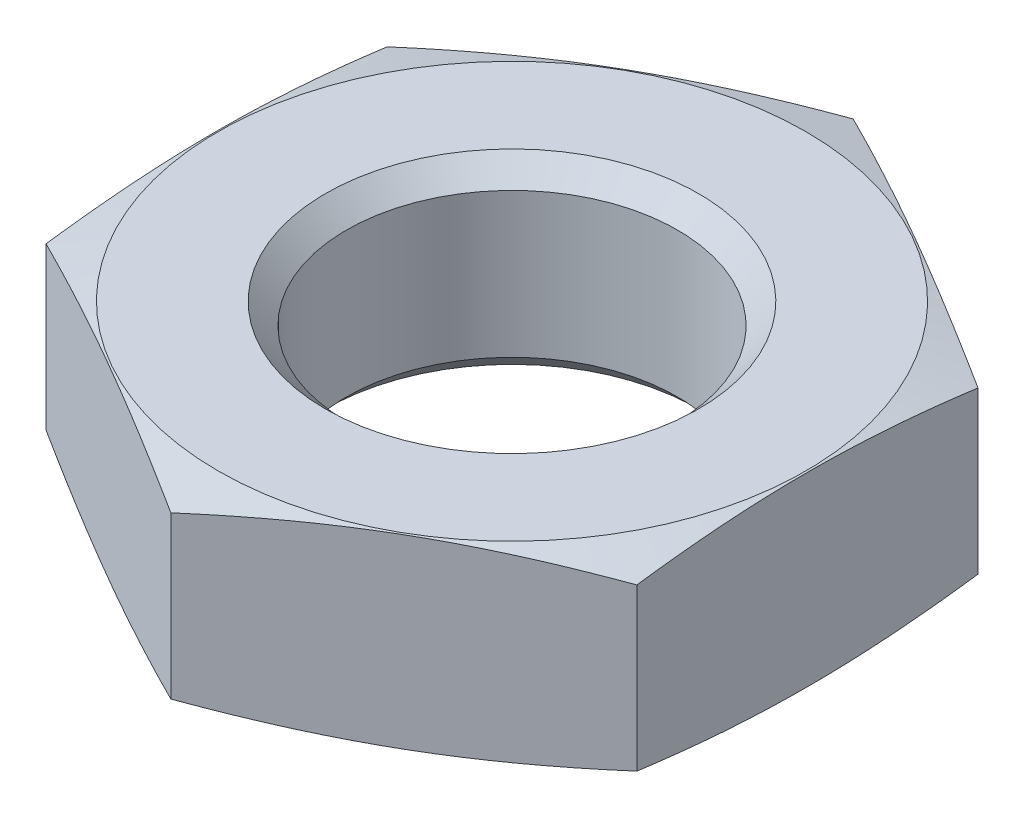
ISO-10303-21;
HEADER;
FILE_DESCRIPTION(('STEP AP214'),'2;1');
FILE_NAME('part.step','',(''),(''),'','','');
FILE_SCHEMA(('AUTOMOTIVE_DESIGN { 1 0 10303 214 1 1 1 1 }'));
ENDSEC;
DATA;
#1=APPLICATION_CONTEXT('core data for automotive mechanical design processes');
#2=APPLICATION_PROTOCOL_DEFINITION('international standard','automotive_design',2000,#1);
#3=PRODUCT_CONTEXT('',#1,'mechanical');
#4=PRODUCT('Part','Part','',(#3));
#5=PRODUCT_RELATED_PRODUCT_CATEGORY('part','',(#4));
#6=PRODUCT_DEFINITION_FORMATION('','',#4);
#7=PRODUCT_DEFINITION_CONTEXT('part definition',#1,'design');
#8=PRODUCT_DEFINITION('design','',#6,#7);
#9=PRODUCT_DEFINITION_SHAPE('','',#8);
#10=(LENGTH_UNIT() NAMED_UNIT(*) SI_UNIT(.MILLI.,.METRE.));
#11=(NAMED_UNIT(*) PLANE_ANGLE_UNIT() SI_UNIT($,.RADIAN.));
#12=(NAMED_UNIT(*) SI_UNIT($,.STERADIAN.) SOLID_ANGLE_UNIT());
#13=UNCERTAINTY_MEASURE_WITH_UNIT(LENGTH_MEASURE(1.E-05),#10,'distance_accuracy_value','');
#14=(GEOMETRIC_REPRESENTATION_CONTEXT(3) GLOBAL_UNCERTAINTY_ASSIGNED_CONTEXT((#13)) GLOBAL_UNIT_ASSIGNED_CONTEXT((#10,
#11,#12)) REPRESENTATION_CONTEXT('',''));
#15=CARTESIAN_POINT('',(0.,0.,0.));
#16=DIRECTION('',(0.,0.,1.));
#17=DIRECTION('',(1.,0.,0.));
#18=AXIS2_PLACEMENT_3D('',#15,#16,#17);
#19=CARTESIAN_POINT('',(0.,0.,0.));
#20=DIRECTION('',(0.,1.,0.));
#21=DIRECTION('',(0.,0.,1.));
#22=AXIS2_PLACEMENT_3D('',#19,#20,#21);
#23=PLANE('',#22);
#24=CARTESIAN_POINT('',(0.,0.,0.));
#25=DIRECTION('',(0.,-1.,0.));
#26=DIRECTION('',(0.,0.,-1.));
#27=AXIS2_PLACEMENT_3D('',#24,#25,#26);
#28=CIRCLE('',#27,9.45);
#29=CARTESIAN_POINT('',(0.,0.,-9.45));
#30=VERTEX_POINT('',#29);
#31=EDGE_CURVE('E119',#30,#30,#28,.T.);
#32=ORIENTED_EDGE('',*,*,#31,.F.);
#33=EDGE_LOOP('',(#32));
#34=FACE_BOUND('',#33,.T.);
#35=CARTESIAN_POINT('',(0.,0.,0.));
#36=DIRECTION('',(0.,1.,0.));
#37=DIRECTION('',(0.,0.,1.));
#38=AXIS2_PLACEMENT_3D('',#35,#36,#37);
#39=CIRCLE('',#38,6.);
#40=CARTESIAN_POINT('',(0.,0.,6.));
#41=VERTEX_POINT('',#40);
#42=EDGE_CURVE('E110',#41,#41,#39,.T.);
#43=ORIENTED_EDGE('',*,*,#42,.F.);
#44=EDGE_LOOP('',(#43));
#45=FACE_BOUND('',#44,.T.);
#46=ADVANCED_FACE('F41',(#34,#45),#23,.T.);
#47=CARTESIAN_POINT('',(9.45,-6.,0.));
#48=DIRECTION('',(0.,-1.,0.));
#49=DIRECTION('',(0.,0.,-1.));
#50=AXIS2_PLACEMENT_3D('',#47,#48,#49);
#51=PLANE('',#50);
#52=CARTESIAN_POINT('',(0.,-6.,0.));
#53=DIRECTION('',(0.,-1.,0.));
#54=DIRECTION('',(0.,0.,-1.));
#55=AXIS2_PLACEMENT_3D('',#52,#53,#54);
#56=CIRCLE('',#55,9.45);
#57=CARTESIAN_POINT('',(0.,-6.,-9.45));
#58=VERTEX_POINT('',#57);
#59=EDGE_CURVE('E116',#58,#58,#56,.T.);
#60=ORIENTED_EDGE('',*,*,#59,.T.);
#61=EDGE_LOOP('',(#60));
#62=FACE_BOUND('',#61,.T.);
#63=CARTESIAN_POINT('',(0.,-6.,0.));
#64=DIRECTION('',(0.,1.,0.));
#65=DIRECTION('',(0.,0.,1.));
#66=AXIS2_PLACEMENT_3D('',#63,#64,#65);
#67=CIRCLE('',#66,6.);
#68=CARTESIAN_POINT('',(0.,-6.,6.));
#69=VERTEX_POINT('',#68);
#70=EDGE_CURVE('E354',#69,#69,#67,.T.);
#71=ORIENTED_EDGE('',*,*,#70,.T.);
#72=EDGE_LOOP('',(#71));
#73=FACE_BOUND('',#72,.T.);
#74=ADVANCED_FACE('F142',(#62,#73),#51,.T.);
#75=CARTESIAN_POINT('',(0.,-3.,0.));
#76=DIRECTION('',(0.,-1.,0.));
#77=DIRECTION('',(0.,0.,-1.));
#78=AXIS2_PLACEMENT_3D('',#75,#76,#77);
#79=CONICAL_SURFACE('',#78,20.646152422707,1.30899693899576);
#80=ORIENTED_EDGE('',*,*,#31,.T.);
#81=EDGE_LOOP('',(#80));
#82=FACE_BOUND('',#81,.T.);
#83=CARTESIAN_POINT('',(0.000200000000000056,-0.407221301327885,-10.9697705846568));
#84=CARTESIAN_POINT('',(-0.394327722084066,-0.346162628123163,-10.7419898981088));
#85=CARTESIAN_POINT('',(-0.789570756660775,-0.290731476819736,-10.5137962257006));
#86=CARTESIAN_POINT('',(-1.581452623938,-0.193344199932058,-10.0566030164617));
#87=CARTESIAN_POINT('',(-1.97809195762644,-0.151393547355208,-9.82760319038551));
#88=CARTESIAN_POINT('',(-2.77036165664143,-0.0834162658033326,-9.37018606638841));
#89=CARTESIAN_POINT('',(-3.16598666491861,-0.0573085729421514,-9.14177186136143));
#90=CARTESIAN_POINT('',(-3.95774119043103,-0.0223008344010164,-8.68465217292471));
#91=CARTESIAN_POINT('',(-4.35387059521551,-0.0133974596215648,-8.45594675443846));
#92=CARTESIAN_POINT('',(-5.14612940478448,-0.0133974596215617,-7.99853591746594));
#93=CARTESIAN_POINT('',(-5.54225880956897,-0.0223008344010103,-7.76983049897969));
#94=CARTESIAN_POINT('',(-6.33401333508139,-0.0573085729421384,-7.31271081054298));
#95=CARTESIAN_POINT('',(-6.72963834335857,-0.0834162658033158,-7.08429660551599));
#96=CARTESIAN_POINT('',(-7.52190804237356,-0.151393547355185,-6.62687948151889));
#97=CARTESIAN_POINT('',(-7.918547376062,-0.193344199932032,-6.39787965544267));
#98=CARTESIAN_POINT('',(-8.71042924333922,-0.290731476819705,-5.94068644620377));
#99=CARTESIAN_POINT('',(-9.10567227791593,-0.34616262812313,-5.71249277379557));
#100=CARTESIAN_POINT('',(-9.5002,-0.407221301327848,-5.48471208724756));
#101=B_SPLINE_CURVE_WITH_KNOTS('',3,(#83,#84,#85,#86,#87,#88,#89,#90,#91,#92,#93,#94,#95,#96,
#97,#98,#99,#100),.UNSPECIFIED.,.F.,.F.,(4,2,2,2,2,2,2,2,4),(0.,1.3789772207545,
2.75851359330416,4.13093041065499,5.50308163364597,6.87523285663696,8.24764967398779,
9.62718604653745,11.0061632672919),.UNSPECIFIED.);
#102=CARTESIAN_POINT('',(0.,-0.407190360731685,-10.969655114603));
#103=VERTEX_POINT('',#102);
#104=CARTESIAN_POINT('',(-9.5,-0.407190360731649,-5.4848275573014));
#105=VERTEX_POINT('',#104);
#106=EDGE_CURVE('E115',#103,#105,#101,.T.);
#107=ORIENTED_EDGE('',*,*,#106,.T.);
#108=CARTESIAN_POINT('',(-9.5,-2.15489501698503,-14.6876233707618));
#109=CARTESIAN_POINT('',(-9.5,-2.05747716397326,-14.2545187729878));
#110=CARTESIAN_POINT('',(-9.5,-1.96122137129006,-13.8211481413857));
#111=CARTESIAN_POINT('',(-9.5,-1.77166156275838,-12.9537437450985));
#112=CARTESIAN_POINT('',(-9.5,-1.67835766923983,-12.5197099537106));
#113=CARTESIAN_POINT('',(-9.5,-1.49525385277399,-11.6504869953931));
#114=CARTESIAN_POINT('',(-9.5,-1.40545721001753,-11.2152971350782));
#115=CARTESIAN_POINT('',(-9.5,-1.23030852784947,-10.3440243718609));
#116=CARTESIAN_POINT('',(-9.5,-1.14495645264905,-9.90794147617888));
#117=CARTESIAN_POINT('',(-9.5,-0.980435214143318,-9.03829746415853));
#118=CARTESIAN_POINT('',(-9.5,-0.901221214976989,-8.60474487085485));
#119=CARTESIAN_POINT('',(-9.5,-0.749512932392226,-7.73645645042536));
#120=CARTESIAN_POINT('',(-9.5,-0.67701867314438,-7.30172061904929));
#121=CARTESIAN_POINT('',(-9.5,-0.540346841485042,-6.43097416556345));
#122=CARTESIAN_POINT('',(-9.5,-0.476168490905241,-5.99496366664183));
#123=CARTESIAN_POINT('',(-9.5,-0.357986001125337,-5.12155005840548));
#124=CARTESIAN_POINT('',(-9.5,-0.303981879128376,-4.68414694673731));
#125=CARTESIAN_POINT('',(-9.5,-0.207635614421435,-3.80292659185121));
#126=CARTESIAN_POINT('',(-9.5,-0.165435340010282,-3.35909360698235));
#127=CARTESIAN_POINT('',(-9.5,-0.0955852694741966,-2.47027404803031));
#128=CARTESIAN_POINT('',(-9.5,-0.067935139015511,-2.02528750068985));
#129=CARTESIAN_POINT('',(-9.5,-0.0287954228788492,-1.13481553211756));
#130=CARTESIAN_POINT('',(-9.5,-0.0172976571081556,-0.689330477833301));
#131=CARTESIAN_POINT('',(-9.5,-0.0111732764429912,0.201756887724333));
#132=CARTESIAN_POINT('',(-9.5,-0.0165466177806685,0.647359198690513));
#133=CARTESIAN_POINT('',(-9.5,-0.0438678679527058,1.53978594873361));
#134=CARTESIAN_POINT('',(-9.5,-0.065880392707515,1.98660836874645));
#135=CARTESIAN_POINT('',(-9.5,-0.12521232749421,2.87922648621127));
#136=CARTESIAN_POINT('',(-9.5,-0.162532088532708,3.32502215988343));
#137=CARTESIAN_POINT('',(-9.5,-0.250549736602095,4.21558410441264));
#138=CARTESIAN_POINT('',(-9.5,-0.301256943409479,4.66034943954976));
#139=CARTESIAN_POINT('',(-9.5,-0.41388476580013,5.5484407314659));
#140=CARTESIAN_POINT('',(-9.5,-0.475805399572583,5.99176668590894));
#141=CARTESIAN_POINT('',(-9.5,-0.610063914957439,6.88527481636762));
#142=CARTESIAN_POINT('',(-9.5,-0.682574416845879,7.33543081010672));
#143=CARTESIAN_POINT('',(-9.5,-0.835259104971586,8.23444833182316));
#144=CARTESIAN_POINT('',(-9.5,-0.915433574034223,8.68330981139851));
#145=CARTESIAN_POINT('',(-9.5,-1.08192720990757,9.57994824082579));
#146=CARTESIAN_POINT('',(-9.5,-1.16824720653629,10.027725035742));
#147=CARTESIAN_POINT('',(-9.5,-1.34580245800188,10.9222931334809));
#148=CARTESIAN_POINT('',(-9.5,-1.43703765140253,11.3690844485486));
#149=CARTESIAN_POINT('',(-9.5,-1.62349726499246,12.2619975970574));
#150=CARTESIAN_POINT('',(-9.5,-1.71872309563522,12.7081191350725));
#151=CARTESIAN_POINT('',(-9.5,-1.91238897494238,13.599665084764));
#152=CARTESIAN_POINT('',(-9.5,-2.01082904385705,14.0450894920299));
#153=CARTESIAN_POINT('',(-9.5,-2.31003706070183,15.3804090328938));
#154=CARTESIAN_POINT('',(-9.5,-2.51470939288304,16.2694287321673));
#155=CARTESIAN_POINT('',(-9.5,-2.92881555735452,18.0359120404948));
#156=CARTESIAN_POINT('',(-9.5,-3.13817104104766,18.9133941407769));
#157=CARTESIAN_POINT('',(-9.5,-3.56181713880884,20.6671864128034));
#158=CARTESIAN_POINT('',(-9.5,-3.77610787087814,21.5434965559953));
#159=CARTESIAN_POINT('',(-9.5,-4.20796592393956,23.2939297294701));
#160=CARTESIAN_POINT('',(-9.5,-4.42552791861861,24.1680540764188));
#161=CARTESIAN_POINT('',(-9.5,-4.75388716488787,25.4787173362136));
#162=CARTESIAN_POINT('',(-9.5,-4.86367423099838,25.9155097694938));
#163=CARTESIAN_POINT('',(-9.5,-5.08384125733177,26.7889447527411));
#164=CARTESIAN_POINT('',(-9.5,-5.19422121697805,27.2255873028535));
#165=CARTESIAN_POINT('',(-9.5,-5.30485748218315,27.6621648928456));
#166=B_SPLINE_CURVE_WITH_KNOTS('',3,(#108,#109,#110,#111,#112,#113,#114,#115,#116,#117,#118,
#119,#120,#121,#122,#123,#124,#125,#126,#127,#128,#129,#130,#131,#132,#133,#134,#135,#136,#137,
#138,#139,#140,#141,#142,#143,#144,#145,#146,#147,#148,#149,#150,#151,#152,#153,#154,#155,#156,
#157,#158,#159,#160,#161,#162,#163,#164,#165),.UNSPECIFIED.,.F.,.F.,(4,2,2,2,2,2,2,2,2,2,2,2,2,
2,2,2,2,2,2,2,2,2,2,2,2,2,2,2,4),(0.,1.33178163560064,2.66361838958637,3.99667230319012,
5.32971548103093,6.6518625097517,7.97401429398861,9.29604226724846,10.6180724758454,
11.9553688719565,13.2926345382789,14.6292227245148,15.965807443311,17.3076094374081,
18.6494422017694,19.9922115681079,21.3349831125585,22.70277681091,24.0706210048084,
25.4386502474928,26.8066623948144,28.1751621999142,29.5436706284689,32.2804475547124,
34.9867644689635,37.6931461582769,40.3955171584583,41.7466524566337,43.0977864410502),.UNSPECIFIED.);
#167=CARTESIAN_POINT('',(-9.5,-0.407190360731649,5.4848275573014));
#168=VERTEX_POINT('',#167);
#169=EDGE_CURVE('E107',#105,#168,#166,.T.);
#170=ORIENTED_EDGE('',*,*,#169,.T.);
#171=CARTESIAN_POINT('',(-9.5002,-0.407221301327849,5.48471208724756));
#172=CARTESIAN_POINT('',(-9.10567227791593,-0.34616262812313,5.71249277379558));
#173=CARTESIAN_POINT('',(-8.71042924333922,-0.290731476819705,5.94068644620377));
#174=CARTESIAN_POINT('',(-7.918547376062,-0.193344199932033,6.39787965544267));
#175=CARTESIAN_POINT('',(-7.52190804237356,-0.151393547355186,6.62687948151889));
#176=CARTESIAN_POINT('',(-6.72963834335857,-0.0834162658033161,7.08429660551599));
#177=CARTESIAN_POINT('',(-6.33401333508139,-0.057308572942138,7.31271081054298));
#178=CARTESIAN_POINT('',(-5.54225880956897,-0.0223008344010096,7.76983049897969));
#179=CARTESIAN_POINT('',(-5.14612940478448,-0.0133974596215615,7.99853591746594));
#180=CARTESIAN_POINT('',(-4.35387059521552,-0.0133974596215649,8.45594675443846));
#181=CARTESIAN_POINT('',(-3.95774119043103,-0.0223008344010164,8.68465217292471));
#182=CARTESIAN_POINT('',(-3.16598666491861,-0.0573085729421515,9.14177186136143));
#183=CARTESIAN_POINT('',(-2.77036165664143,-0.0834162658033331,9.37018606638841));
#184=CARTESIAN_POINT('',(-1.97809195762645,-0.151393547355209,9.82760319038551));
#185=CARTESIAN_POINT('',(-1.581452623938,-0.193344199932058,10.0566030164617));
#186=CARTESIAN_POINT('',(-0.789570756660778,-0.290731476819735,10.5137962257006));
#187=CARTESIAN_POINT('',(-0.394327722084069,-0.346162628123163,10.7419898981088));
#188=CARTESIAN_POINT('',(0.000199999999998323,-0.407221301327884,10.9697705846568));
#189=B_SPLINE_CURVE_WITH_KNOTS('',3,(#171,#172,#173,#174,#175,#176,#177,#178,#179,#180,#181,
#182,#183,#184,#185,#186,#187,#188),.UNSPECIFIED.,.F.,.F.,(4,2,2,2,2,2,2,2,4),(0.,
1.3789772207545,2.75851359330416,4.13093041065499,5.50308163364597,6.87523285663696,
8.24764967398779,9.62718604653745,11.0061632672919),.UNSPECIFIED.);
#190=CARTESIAN_POINT('',(0.,-0.407190360731686,10.969655114603));
#191=VERTEX_POINT('',#190);
#192=EDGE_CURVE('E96',#168,#191,#189,.T.);
#193=ORIENTED_EDGE('',*,*,#192,.T.);
#194=CARTESIAN_POINT('',(-0.000200000000000056,-0.407221301327885,10.9697705846568));
#195=CARTESIAN_POINT('',(0.394327722084066,-0.346162628123163,10.7419898981088));
#196=CARTESIAN_POINT('',(0.789570756660775,-0.290731476819736,10.5137962257006));
#197=CARTESIAN_POINT('',(1.581452623938,-0.193344199932058,10.0566030164617));
#198=CARTESIAN_POINT('',(1.97809195762644,-0.151393547355208,9.82760319038551));
#199=CARTESIAN_POINT('',(2.77036165664143,-0.0834162658033326,9.37018606638841));
#200=CARTESIAN_POINT('',(3.16598666491861,-0.0573085729421514,9.14177186136143));
#201=CARTESIAN_POINT('',(3.95774119043103,-0.0223008344010164,8.68465217292471));
#202=CARTESIAN_POINT('',(4.35387059521551,-0.0133974596215648,8.45594675443846));
#203=CARTESIAN_POINT('',(5.14612940478448,-0.0133974596215617,7.99853591746594));
#204=CARTESIAN_POINT('',(5.54225880956897,-0.0223008344010103,7.76983049897969));
#205=CARTESIAN_POINT('',(6.33401333508139,-0.0573085729421384,7.31271081054298));
#206=CARTESIAN_POINT('',(6.72963834335857,-0.0834162658033158,7.08429660551599));
#207=CARTESIAN_POINT('',(7.52190804237356,-0.151393547355185,6.62687948151889));
#208=CARTESIAN_POINT('',(7.918547376062,-0.193344199932032,6.39787965544267));
#209=CARTESIAN_POINT('',(8.71042924333922,-0.290731476819705,5.94068644620377));
#210=CARTESIAN_POINT('',(9.10567227791593,-0.34616262812313,5.71249277379557));
#211=CARTESIAN_POINT('',(9.5002,-0.407221301327848,5.48471208724756));
#212=B_SPLINE_CURVE_WITH_KNOTS('',3,(#194,#195,#196,#197,#198,#199,#200,#201,#202,#203,#204,
#205,#206,#207,#208,#209,#210,#211),.UNSPECIFIED.,.F.,.F.,(4,2,2,2,2,2,2,2,4),(0.,
1.3789772207545,2.75851359330416,4.13093041065499,5.50308163364597,6.87523285663696,
8.24764967398779,9.62718604653745,11.0061632672919),.UNSPECIFIED.);
#213=CARTESIAN_POINT('',(9.5,-0.407190360731649,5.4848275573014));
#214=VERTEX_POINT('',#213);
#215=EDGE_CURVE('E101',#191,#214,#212,.T.);
#216=ORIENTED_EDGE('',*,*,#215,.T.);
#217=CARTESIAN_POINT('',(9.5,-2.15489501698503,-14.6876233707618));
#218=CARTESIAN_POINT('',(9.5,-2.05747716397326,-14.2545187729878));
#219=CARTESIAN_POINT('',(9.5,-1.96122137129006,-13.8211481413857));
#220=CARTESIAN_POINT('',(9.5,-1.77166156275838,-12.9537437450985));
#221=CARTESIAN_POINT('',(9.5,-1.67835766923983,-12.5197099537106));
#222=CARTESIAN_POINT('',(9.5,-1.49525385277399,-11.6504869953931));
#223=CARTESIAN_POINT('',(9.5,-1.40545721001753,-11.2152971350782));
#224=CARTESIAN_POINT('',(9.5,-1.23030852784947,-10.3440243718609));
#225=CARTESIAN_POINT('',(9.5,-1.14495645264905,-9.90794147617888));
#226=CARTESIAN_POINT('',(9.5,-0.980435214143318,-9.03829746415853));
#227=CARTESIAN_POINT('',(9.5,-0.901221214976989,-8.60474487085485));
#228=CARTESIAN_POINT('',(9.5,-0.749512932392226,-7.73645645042536));
#229=CARTESIAN_POINT('',(9.5,-0.67701867314438,-7.30172061904929));
#230=CARTESIAN_POINT('',(9.5,-0.540346841485042,-6.43097416556345));
#231=CARTESIAN_POINT('',(9.5,-0.476168490905241,-5.99496366664183));
#232=CARTESIAN_POINT('',(9.5,-0.357986001125337,-5.12155005840548));
#233=CARTESIAN_POINT('',(9.5,-0.303981879128376,-4.68414694673731));
#234=CARTESIAN_POINT('',(9.5,-0.207635614421435,-3.80292659185121));
#235=CARTESIAN_POINT('',(9.5,-0.165435340010282,-3.35909360698235));
#236=CARTESIAN_POINT('',(9.5,-0.0955852694741966,-2.47027404803031));
#237=CARTESIAN_POINT('',(9.5,-0.067935139015511,-2.02528750068985));
#238=CARTESIAN_POINT('',(9.5,-0.0287954228788492,-1.13481553211756));
#239=CARTESIAN_POINT('',(9.5,-0.0172976571081556,-0.689330477833301));
#240=CARTESIAN_POINT('',(9.5,-0.0111732764429912,0.201756887724333));
#241=CARTESIAN_POINT('',(9.5,-0.0165466177806685,0.647359198690513));
#242=CARTESIAN_POINT('',(9.5,-0.0438678679527058,1.53978594873361));
#243=CARTESIAN_POINT('',(9.5,-0.065880392707515,1.98660836874645));
#244=CARTESIAN_POINT('',(9.5,-0.12521232749421,2.87922648621127));
#245=CARTESIAN_POINT('',(9.5,-0.162532088532708,3.32502215988343));
#246=CARTESIAN_POINT('',(9.5,-0.250549736602095,4.21558410441264));
#247=CARTESIAN_POINT('',(9.5,-0.301256943409479,4.66034943954976));
#248=CARTESIAN_POINT('',(9.5,-0.41388476580013,5.5484407314659));
#249=CARTESIAN_POINT('',(9.5,-0.475805399572583,5.99176668590894));
#250=CARTESIAN_POINT('',(9.5,-0.610063914957439,6.88527481636762));
#251=CARTESIAN_POINT('',(9.5,-0.682574416845879,7.33543081010672));
#252=CARTESIAN_POINT('',(9.5,-0.835259104971586,8.23444833182316));
#253=CARTESIAN_POINT('',(9.5,-0.915433574034223,8.68330981139851));
#254=CARTESIAN_POINT('',(9.5,-1.08192720990757,9.57994824082579));
#255=CARTESIAN_POINT('',(9.5,-1.16824720653629,10.027725035742));
#256=CARTESIAN_POINT('',(9.5,-1.34580245800188,10.9222931334809));
#257=CARTESIAN_POINT('',(9.5,-1.43703765140253,11.3690844485486));
#258=CARTESIAN_POINT('',(9.5,-1.62349726499246,12.2619975970574));
#259=CARTESIAN_POINT('',(9.5,-1.71872309563522,12.7081191350725));
#260=CARTESIAN_POINT('',(9.5,-1.91238897494238,13.599665084764));
#261=CARTESIAN_POINT('',(9.5,-2.01082904385705,14.0450894920299));
#262=CARTESIAN_POINT('',(9.5,-2.31003706070183,15.3804090328938));
#263=CARTESIAN_POINT('',(9.5,-2.51470939288304,16.2694287321673));
#264=CARTESIAN_POINT('',(9.5,-2.92881555735452,18.0359120404948));
#265=CARTESIAN_POINT('',(9.5,-3.13817104104766,18.9133941407769));
#266=CARTESIAN_POINT('',(9.5,-3.56181713880884,20.6671864128034));
#267=CARTESIAN_POINT('',(9.5,-3.77610787087814,21.5434965559953));
#268=CARTESIAN_POINT('',(9.5,-4.20796592393956,23.2939297294701));
#269=CARTESIAN_POINT('',(9.5,-4.42552791861861,24.1680540764188));
#270=CARTESIAN_POINT('',(9.5,-4.75388716488787,25.4787173362136));
#271=CARTESIAN_POINT('',(9.5,-4.86367423099838,25.9155097694938));
#272=CARTESIAN_POINT('',(9.5,-5.08384125733177,26.7889447527411));
#273=CARTESIAN_POINT('',(9.5,-5.19422121697805,27.2255873028535));
#274=CARTESIAN_POINT('',(9.5,-5.30485748218315,27.6621648928456));
#275=B_SPLINE_CURVE_WITH_KNOTS('',3,(#217,#218,#219,#220,#221,#222,#223,#224,#225,#226,#227,
#228,#229,#230,#231,#232,#233,#234,#235,#236,#237,#238,#239,#240,#241,#242,#243,#244,#245,#246,
#247,#248,#249,#250,#251,#252,#253,#254,#255,#256,#257,#258,#259,#260,#261,#262,#263,#264,#265,
#266,#267,#268,#269,#270,#271,#272,#273,#274),.UNSPECIFIED.,.F.,.F.,(4,2,2,2,2,2,2,2,2,2,2,2,2,
2,2,2,2,2,2,2,2,2,2,2,2,2,2,2,4),(0.,1.33178163560064,2.66361838958637,3.99667230319012,
5.32971548103093,6.6518625097517,7.97401429398861,9.29604226724846,10.6180724758454,
11.9553688719565,13.2926345382789,14.6292227245148,15.965807443311,17.3076094374081,
18.6494422017694,19.9922115681079,21.3349831125585,22.70277681091,24.0706210048084,
25.4386502474928,26.8066623948144,28.1751621999142,29.5436706284689,32.2804475547124,
34.9867644689635,37.6931461582769,40.3955171584583,41.7466524566337,43.0977864410502),.UNSPECIFIED.);
#276=CARTESIAN_POINT('',(9.5,-0.407190360731649,-5.4848275573014));
#277=VERTEX_POINT('',#276);
#278=EDGE_CURVE('E205',#214,#277,#275,.F.);
#279=ORIENTED_EDGE('',*,*,#278,.T.);
#280=CARTESIAN_POINT('',(9.5002,-0.407221301327849,-5.48471208724756));
#281=CARTESIAN_POINT('',(9.10567227791593,-0.34616262812313,-5.71249277379558));
#282=CARTESIAN_POINT('',(8.71042924333922,-0.290731476819705,-5.94068644620377));
#283=CARTESIAN_POINT('',(7.918547376062,-0.193344199932033,-6.39787965544267));
#284=CARTESIAN_POINT('',(7.52190804237356,-0.151393547355186,-6.62687948151889));
#285=CARTESIAN_POINT('',(6.72963834335857,-0.0834162658033161,-7.08429660551599));
#286=CARTESIAN_POINT('',(6.33401333508139,-0.057308572942138,-7.31271081054298));
#287=CARTESIAN_POINT('',(5.54225880956897,-0.0223008344010096,-7.76983049897969));
#288=CARTESIAN_POINT('',(5.14612940478448,-0.0133974596215615,-7.99853591746594));
#289=CARTESIAN_POINT('',(4.35387059521552,-0.0133974596215649,-8.45594675443846));
#290=CARTESIAN_POINT('',(3.95774119043103,-0.0223008344010164,-8.68465217292471));
#291=CARTESIAN_POINT('',(3.16598666491861,-0.0573085729421515,-9.14177186136143));
#292=CARTESIAN_POINT('',(2.77036165664143,-0.0834162658033331,-9.37018606638841));
#293=CARTESIAN_POINT('',(1.97809195762645,-0.151393547355209,-9.82760319038551));
#294=CARTESIAN_POINT('',(1.581452623938,-0.193344199932058,-10.0566030164617));
#295=CARTESIAN_POINT('',(0.789570756660778,-0.290731476819735,-10.5137962257006));
#296=CARTESIAN_POINT('',(0.394327722084069,-0.346162628123163,-10.7419898981088));
#297=CARTESIAN_POINT('',(-0.000199999999998323,-0.407221301327884,-10.9697705846568));
#298=B_SPLINE_CURVE_WITH_KNOTS('',3,(#280,#281,#282,#283,#284,#285,#286,#287,#288,#289,#290,
#291,#292,#293,#294,#295,#296,#297),.UNSPECIFIED.,.F.,.F.,(4,2,2,2,2,2,2,2,4),(0.,
1.3789772207545,2.75851359330416,4.13093041065499,5.50308163364597,6.87523285663696,
8.24764967398779,9.62718604653745,11.0061632672919),.UNSPECIFIED.);
#299=EDGE_CURVE('E121',#277,#103,#298,.T.);
#300=ORIENTED_EDGE('',*,*,#299,.T.);
#301=EDGE_LOOP('',(#107,#170,#193,#216,#279,#300));
#302=FACE_BOUND('',#301,.T.);
#303=ADVANCED_FACE('F113',(#82,#302),#79,.T.);
#304=CARTESIAN_POINT('',(-9.5,-7.,-5.4848275573014));
#305=DIRECTION('',(-1.,0.,0.));
#306=DIRECTION('',(0.,0.,1.));
#307=AXIS2_PLACEMENT_3D('',#304,#305,#306);
#308=PLANE('',#307);
#309=DIRECTION('',(0.,1.,0.));
#310=VECTOR('',#309,1.);
#311=CARTESIAN_POINT('',(-9.5,-7.,-5.4848275573014));
#312=LINE('',#311,#310);
#313=CARTESIAN_POINT('',(-9.5,-5.59280963926835,-5.4848275573014));
#314=VERTEX_POINT('',#313);
#315=EDGE_CURVE('E102',#314,#105,#312,.T.);
#316=ORIENTED_EDGE('',*,*,#315,.F.);
#317=CARTESIAN_POINT('',(-9.5,-3.84510498301497,-14.6876233707618));
#318=CARTESIAN_POINT('',(-9.5,-3.94252283602674,-14.2545187729878));
#319=CARTESIAN_POINT('',(-9.5,-4.03877862870994,-13.8211481413857));
#320=CARTESIAN_POINT('',(-9.5,-4.22833843724162,-12.9537437450985));
#321=CARTESIAN_POINT('',(-9.5,-4.32164233076017,-12.5197099537106));
#322=CARTESIAN_POINT('',(-9.5,-4.504746147226,-11.6504869953931));
#323=CARTESIAN_POINT('',(-9.5,-4.59454278998247,-11.2152971350782));
#324=CARTESIAN_POINT('',(-9.5,-4.76969147215053,-10.3440243718609));
#325=CARTESIAN_POINT('',(-9.5,-4.85504354735095,-9.90794147617889));
#326=CARTESIAN_POINT('',(-9.5,-5.01956478585668,-9.03829746415854));
#327=CARTESIAN_POINT('',(-9.5,-5.09877878502301,-8.60474487085485));
#328=CARTESIAN_POINT('',(-9.5,-5.25048706760777,-7.73645645042536));
#329=CARTESIAN_POINT('',(-9.5,-5.32298132685562,-7.30172061904929));
#330=CARTESIAN_POINT('',(-9.5,-5.45965315851496,-6.43097416556345));
#331=CARTESIAN_POINT('',(-9.5,-5.52383150909476,-5.99496366664184));
#332=CARTESIAN_POINT('',(-9.5,-5.64201399887466,-5.12155005840549));
#333=CARTESIAN_POINT('',(-9.5,-5.69601812087162,-4.68414694673732));
#334=CARTESIAN_POINT('',(-9.5,-5.79236438557856,-3.80292659185121));
#335=CARTESIAN_POINT('',(-9.5,-5.83456465998972,-3.35909360698235));
#336=CARTESIAN_POINT('',(-9.5,-5.9044147305258,-2.47027404803031));
#337=CARTESIAN_POINT('',(-9.5,-5.93206486098449,-2.02528750068985));
#338=CARTESIAN_POINT('',(-9.5,-5.97120457712115,-1.13481553211756));
#339=CARTESIAN_POINT('',(-9.5,-5.98270234289184,-0.6893304778333));
#340=CARTESIAN_POINT('',(-9.5,-5.98882672355701,0.201756887724334));
#341=CARTESIAN_POINT('',(-9.5,-5.98345338221933,0.647359198690514));
#342=CARTESIAN_POINT('',(-9.5,-5.95613213204729,1.53978594873361));
#343=CARTESIAN_POINT('',(-9.5,-5.93411960729249,1.98660836874645));
#344=CARTESIAN_POINT('',(-9.5,-5.87478767250579,2.87922648621127));
#345=CARTESIAN_POINT('',(-9.5,-5.83746791146729,3.32502215988342));
#346=CARTESIAN_POINT('',(-9.5,-5.7494502633979,4.21558410441264));
#347=CARTESIAN_POINT('',(-9.5,-5.69874305659052,4.66034943954975));
#348=CARTESIAN_POINT('',(-9.5,-5.58611523419987,5.5484407314659));
#349=CARTESIAN_POINT('',(-9.5,-5.52419460042742,5.99176668590894));
#350=CARTESIAN_POINT('',(-9.5,-5.38993608504256,6.88527481636762));
#351=CARTESIAN_POINT('',(-9.5,-5.31742558315412,7.33543081010672));
#352=CARTESIAN_POINT('',(-9.5,-5.16474089502841,8.23444833182316));
#353=CARTESIAN_POINT('',(-9.5,-5.08456642596578,8.68330981139851));
#354=CARTESIAN_POINT('',(-9.5,-4.91807279009243,9.57994824082579));
#355=CARTESIAN_POINT('',(-9.5,-4.83175279346371,10.027725035742));
#356=CARTESIAN_POINT('',(-9.5,-4.65419754199812,10.9222931334809));
#357=CARTESIAN_POINT('',(-9.5,-4.56296234859747,11.3690844485486));
#358=CARTESIAN_POINT('',(-9.5,-4.37650273500754,12.2619975970574));
#359=CARTESIAN_POINT('',(-9.5,-4.28127690436478,12.7081191350725));
#360=CARTESIAN_POINT('',(-9.5,-4.08761102505762,13.599665084764));
#361=CARTESIAN_POINT('',(-9.5,-3.98917095614295,14.0450894920299));
#362=CARTESIAN_POINT('',(-9.5,-3.68996293929817,15.3804090328938));
#363=CARTESIAN_POINT('',(-9.5,-3.48529060711696,16.2694287321673));
#364=CARTESIAN_POINT('',(-9.5,-3.07118444264548,18.0359120404948));
#365=CARTESIAN_POINT('',(-9.5,-2.86182895895234,18.9133941407769));
#366=CARTESIAN_POINT('',(-9.5,-2.43818286119116,20.6671864128034));
#367=CARTESIAN_POINT('',(-9.5,-2.22389212912186,21.5434965559953));
#368=CARTESIAN_POINT('',(-9.5,-1.79203407606044,23.2939297294701));
#369=CARTESIAN_POINT('',(-9.5,-1.57447208138139,24.1680540764188));
#370=CARTESIAN_POINT('',(-9.5,-1.24611283511213,25.4787173362136));
#371=CARTESIAN_POINT('',(-9.5,-1.13632576900162,25.9155097694938));
#372=CARTESIAN_POINT('',(-9.5,-0.916158742668227,26.7889447527411));
#373=CARTESIAN_POINT('',(-9.5,-0.805778783021947,27.2255873028535));
#374=CARTESIAN_POINT('',(-9.5,-0.69514251781685,27.6621648928456));
#375=B_SPLINE_CURVE_WITH_KNOTS('',3,(#317,#318,#319,#320,#321,#322,#323,#324,#325,#326,#327,
#328,#329,#330,#331,#332,#333,#334,#335,#336,#337,#338,#339,#340,#341,#342,#343,#344,#345,#346,
#347,#348,#349,#350,#351,#352,#353,#354,#355,#356,#357,#358,#359,#360,#361,#362,#363,#364,#365,
#366,#367,#368,#369,#370,#371,#372,#373,#374),.UNSPECIFIED.,.F.,.F.,(4,2,2,2,2,2,2,2,2,2,2,2,2,
2,2,2,2,2,2,2,2,2,2,2,2,2,2,2,4),(0.,1.33178163560064,2.66361838958637,3.99667230319012,
5.32971548103093,6.65186250975169,7.9740142939886,9.29604226724845,10.6180724758454,
11.9553688719565,13.2926345382789,14.6292227245148,15.965807443311,17.3076094374081,
18.6494422017694,19.9922115681079,21.3349831125585,22.70277681091,24.0706210048084,
25.4386502474928,26.8066623948144,28.1751621999142,29.5436706284689,32.2804475547124,
34.9867644689635,37.6931461582769,40.3955171584583,41.7466524566337,43.0977864410502),.UNSPECIFIED.);
#376=CARTESIAN_POINT('',(-9.5,-5.59280963926835,5.4848275573014));
#377=VERTEX_POINT('',#376);
#378=EDGE_CURVE('E11',#377,#314,#375,.F.);
#379=ORIENTED_EDGE('',*,*,#378,.F.);
#380=DIRECTION('',(0.,1.,0.));
#381=VECTOR('',#380,1.);
#382=CARTESIAN_POINT('',(-9.5,-7.,5.4848275573014));
#383=LINE('',#382,#381);
#384=EDGE_CURVE('E66',#377,#168,#383,.T.);
#385=ORIENTED_EDGE('',*,*,#384,.T.);
#386=ORIENTED_EDGE('',*,*,#169,.F.);
#387=EDGE_LOOP('',(#316,#379,#385,#386));
#388=FACE_BOUND('',#387,.T.);
#389=ADVANCED_FACE('F106',(#388),#308,.T.);
#390=CARTESIAN_POINT('',(0.,-7.,-10.969655114603));
#391=DIRECTION('',(-0.500000000000011,0.,-0.866025403784432));
#392=DIRECTION('',(-0.866025403784433,0.,0.500000000000011));
#393=AXIS2_PLACEMENT_3D('',#390,#391,#392);
#394=PLANE('',#393);
#395=DIRECTION('',(0.,1.,0.));
#396=VECTOR('',#395,1.);
#397=CARTESIAN_POINT('',(0.,-7.,-10.969655114603));
#398=LINE('',#397,#396);
#399=CARTESIAN_POINT('',(0.,-5.59280963926831,-10.969655114603));
#400=VERTEX_POINT('',#399);
#401=EDGE_CURVE('E249',#400,#103,#398,.T.);
#402=ORIENTED_EDGE('',*,*,#401,.F.);
#403=CARTESIAN_POINT('',(-9.5002,-5.59277869867215,-5.48471208724756));
#404=CARTESIAN_POINT('',(-9.10567227791593,-5.65383737187687,-5.71249277379557));
#405=CARTESIAN_POINT('',(-8.71042924333922,-5.7092685231803,-5.94068644620377));
#406=CARTESIAN_POINT('',(-7.918547376062,-5.80665580006797,-6.39787965544267));
#407=CARTESIAN_POINT('',(-7.52190804237356,-5.84860645264481,-6.62687948151889));
#408=CARTESIAN_POINT('',(-6.72963834335856,-5.91658373419668,-7.08429660551599));
#409=CARTESIAN_POINT('',(-6.33401333508139,-5.94269142705786,-7.31271081054298));
#410=CARTESIAN_POINT('',(-5.54225880956897,-5.97769916559899,-7.76983049897969));
#411=CARTESIAN_POINT('',(-5.14612940478448,-5.98660254037844,-7.99853591746595));
#412=CARTESIAN_POINT('',(-4.35387059521551,-5.98660254037843,-8.45594675443846));
#413=CARTESIAN_POINT('',(-3.95774119043103,-5.97769916559898,-8.68465217292471));
#414=CARTESIAN_POINT('',(-3.16598666491861,-5.94269142705785,-9.14177186136143));
#415=CARTESIAN_POINT('',(-2.77036165664143,-5.91658373419667,-9.37018606638841));
#416=CARTESIAN_POINT('',(-1.97809195762644,-5.84860645264479,-9.82760319038551));
#417=CARTESIAN_POINT('',(-1.581452623938,-5.80665580006794,-10.0566030164617));
#418=CARTESIAN_POINT('',(-0.789570756660774,-5.70926852318026,-10.5137962257006));
#419=CARTESIAN_POINT('',(-0.394327722084065,-5.65383737187684,-10.7419898981088));
#420=CARTESIAN_POINT('',(0.000200000000001912,-5.59277869867212,-10.9697705846568));
#421=B_SPLINE_CURVE_WITH_KNOTS('',3,(#403,#404,#405,#406,#407,#408,#409,#410,#411,#412,#413,
#414,#415,#416,#417,#418,#419,#420),.UNSPECIFIED.,.F.,.F.,(4,2,2,2,2,2,2,2,4),(0.,
1.3789772207545,2.75851359330416,4.13093041065499,5.50308163364598,6.87523285663696,
8.24764967398779,9.62718604653745,11.0061632672919),.UNSPECIFIED.);
#422=EDGE_CURVE('E54',#314,#400,#421,.T.);
#423=ORIENTED_EDGE('',*,*,#422,.F.);
#424=ORIENTED_EDGE('',*,*,#315,.T.);
#425=ORIENTED_EDGE('',*,*,#106,.F.);
#426=EDGE_LOOP('',(#402,#423,#424,#425));
#427=FACE_BOUND('',#426,.T.);
#428=ADVANCED_FACE('F139',(#427),#394,.T.);
#429=CARTESIAN_POINT('',(9.5,-7.,-5.4848275573014));
#430=DIRECTION('',(0.500000000000011,0.,-0.866025403784432));
#431=DIRECTION('',(-0.866025403784433,0.,-0.500000000000011));
#432=AXIS2_PLACEMENT_3D('',#429,#430,#431);
#433=PLANE('',#432);
#434=DIRECTION('',(0.,1.,0.));
#435=VECTOR('',#434,1.);
#436=CARTESIAN_POINT('',(9.5,-7.,-5.4848275573014));
#437=LINE('',#436,#435);
#438=CARTESIAN_POINT('',(9.5,-5.59280963926835,-5.4848275573014));
#439=VERTEX_POINT('',#438);
#440=EDGE_CURVE('E252',#439,#277,#437,.T.);
#441=ORIENTED_EDGE('',*,*,#440,.F.);
#442=CARTESIAN_POINT('',(-0.000199999999999537,-5.59277869867212,-10.9697705846568));
#443=CARTESIAN_POINT('',(0.394327722084067,-5.65383737187684,-10.7419898981088));
#444=CARTESIAN_POINT('',(0.789570756660776,-5.70926852318026,-10.5137962257006));
#445=CARTESIAN_POINT('',(1.581452623938,-5.80665580006794,-10.0566030164617));
#446=CARTESIAN_POINT('',(1.97809195762644,-5.84860645264479,-9.82760319038551));
#447=CARTESIAN_POINT('',(2.77036165664143,-5.91658373419667,-9.37018606638841));
#448=CARTESIAN_POINT('',(3.16598666491861,-5.94269142705785,-9.14177186136143));
#449=CARTESIAN_POINT('',(3.95774119043103,-5.97769916559898,-8.68465217292471));
#450=CARTESIAN_POINT('',(4.35387059521551,-5.98660254037843,-8.45594675443846));
#451=CARTESIAN_POINT('',(5.14612940478448,-5.98660254037844,-7.99853591746594));
#452=CARTESIAN_POINT('',(5.54225880956897,-5.97769916559899,-7.76983049897969));
#453=CARTESIAN_POINT('',(6.33401333508139,-5.94269142705786,-7.31271081054298));
#454=CARTESIAN_POINT('',(6.72963834335857,-5.91658373419668,-7.08429660551599));
#455=CARTESIAN_POINT('',(7.52190804237356,-5.84860645264481,-6.62687948151889));
#456=CARTESIAN_POINT('',(7.918547376062,-5.80665580006797,-6.39787965544267));
#457=CARTESIAN_POINT('',(8.71042924333922,-5.7092685231803,-5.94068644620377));
#458=CARTESIAN_POINT('',(9.10567227791593,-5.65383737187687,-5.71249277379558));
#459=CARTESIAN_POINT('',(9.5002,-5.59277869867215,-5.48471208724756));
#460=B_SPLINE_CURVE_WITH_KNOTS('',3,(#442,#443,#444,#445,#446,#447,#448,#449,#450,#451,#452,
#453,#454,#455,#456,#457,#458,#459),.UNSPECIFIED.,.F.,.F.,(4,2,2,2,2,2,2,2,4),(0.,
1.3789772207545,2.75851359330416,4.13093041065499,5.50308163364597,6.87523285663696,
8.24764967398779,9.62718604653745,11.0061632672919),.UNSPECIFIED.);
#461=EDGE_CURVE('E176',#400,#439,#460,.T.);
#462=ORIENTED_EDGE('',*,*,#461,.F.);
#463=ORIENTED_EDGE('',*,*,#401,.T.);
#464=ORIENTED_EDGE('',*,*,#299,.F.);
#465=EDGE_LOOP('',(#441,#462,#463,#464));
#466=FACE_BOUND('',#465,.T.);
#467=ADVANCED_FACE('F190',(#466),#433,.T.);
#468=CARTESIAN_POINT('',(9.5,-7.,5.4848275573014));
#469=DIRECTION('',(1.,0.,0.));
#470=DIRECTION('',(0.,0.,-1.));
#471=AXIS2_PLACEMENT_3D('',#468,#469,#470);
#472=PLANE('',#471);
#473=DIRECTION('',(0.,1.,0.));
#474=VECTOR('',#473,1.);
#475=CARTESIAN_POINT('',(9.5,-7.,5.4848275573014));
#476=LINE('',#475,#474);
#477=CARTESIAN_POINT('',(9.5,-5.59280963926835,5.4848275573014));
#478=VERTEX_POINT('',#477);
#479=EDGE_CURVE('E255',#478,#214,#476,.T.);
#480=ORIENTED_EDGE('',*,*,#479,.F.);
#481=CARTESIAN_POINT('',(9.5,-3.84510498301497,-14.6876233707618));
#482=CARTESIAN_POINT('',(9.5,-3.94252283602674,-14.2545187729878));
#483=CARTESIAN_POINT('',(9.5,-4.03877862870994,-13.8211481413857));
#484=CARTESIAN_POINT('',(9.5,-4.22833843724162,-12.9537437450985));
#485=CARTESIAN_POINT('',(9.5,-4.32164233076017,-12.5197099537106));
#486=CARTESIAN_POINT('',(9.5,-4.504746147226,-11.6504869953931));
#487=CARTESIAN_POINT('',(9.5,-4.59454278998247,-11.2152971350782));
#488=CARTESIAN_POINT('',(9.5,-4.76969147215053,-10.3440243718609));
#489=CARTESIAN_POINT('',(9.5,-4.85504354735095,-9.90794147617889));
#490=CARTESIAN_POINT('',(9.5,-5.01956478585668,-9.03829746415854));
#491=CARTESIAN_POINT('',(9.5,-5.09877878502301,-8.60474487085485));
#492=CARTESIAN_POINT('',(9.5,-5.25048706760777,-7.73645645042536));
#493=CARTESIAN_POINT('',(9.5,-5.32298132685562,-7.30172061904929));
#494=CARTESIAN_POINT('',(9.5,-5.45965315851496,-6.43097416556345));
#495=CARTESIAN_POINT('',(9.5,-5.52383150909476,-5.99496366664184));
#496=CARTESIAN_POINT('',(9.5,-5.64201399887466,-5.12155005840549));
#497=CARTESIAN_POINT('',(9.5,-5.69601812087162,-4.68414694673732));
#498=CARTESIAN_POINT('',(9.5,-5.79236438557856,-3.80292659185121));
#499=CARTESIAN_POINT('',(9.5,-5.83456465998972,-3.35909360698235));
#500=CARTESIAN_POINT('',(9.5,-5.9044147305258,-2.47027404803031));
#501=CARTESIAN_POINT('',(9.5,-5.93206486098449,-2.02528750068985));
#502=CARTESIAN_POINT('',(9.5,-5.97120457712115,-1.13481553211756));
#503=CARTESIAN_POINT('',(9.5,-5.98270234289184,-0.6893304778333));
#504=CARTESIAN_POINT('',(9.5,-5.98882672355701,0.201756887724334));
#505=CARTESIAN_POINT('',(9.5,-5.98345338221933,0.647359198690514));
#506=CARTESIAN_POINT('',(9.5,-5.95613213204729,1.53978594873361));
#507=CARTESIAN_POINT('',(9.5,-5.93411960729249,1.98660836874645));
#508=CARTESIAN_POINT('',(9.5,-5.87478767250579,2.87922648621127));
#509=CARTESIAN_POINT('',(9.5,-5.83746791146729,3.32502215988342));
#510=CARTESIAN_POINT('',(9.5,-5.7494502633979,4.21558410441264));
#511=CARTESIAN_POINT('',(9.5,-5.69874305659052,4.66034943954975));
#512=CARTESIAN_POINT('',(9.5,-5.58611523419987,5.5484407314659));
#513=CARTESIAN_POINT('',(9.5,-5.52419460042742,5.99176668590894));
#514=CARTESIAN_POINT('',(9.5,-5.38993608504256,6.88527481636762));
#515=CARTESIAN_POINT('',(9.5,-5.31742558315412,7.33543081010672));
#516=CARTESIAN_POINT('',(9.5,-5.16474089502841,8.23444833182316));
#517=CARTESIAN_POINT('',(9.5,-5.08456642596578,8.68330981139851));
#518=CARTESIAN_POINT('',(9.5,-4.91807279009243,9.57994824082579));
#519=CARTESIAN_POINT('',(9.5,-4.83175279346371,10.027725035742));
#520=CARTESIAN_POINT('',(9.5,-4.65419754199812,10.9222931334809));
#521=CARTESIAN_POINT('',(9.5,-4.56296234859747,11.3690844485486));
#522=CARTESIAN_POINT('',(9.5,-4.37650273500754,12.2619975970574));
#523=CARTESIAN_POINT('',(9.5,-4.28127690436478,12.7081191350725));
#524=CARTESIAN_POINT('',(9.5,-4.08761102505762,13.599665084764));
#525=CARTESIAN_POINT('',(9.5,-3.98917095614295,14.0450894920299));
#526=CARTESIAN_POINT('',(9.5,-3.68996293929817,15.3804090328938));
#527=CARTESIAN_POINT('',(9.5,-3.48529060711696,16.2694287321673));
#528=CARTESIAN_POINT('',(9.5,-3.07118444264548,18.0359120404948));
#529=CARTESIAN_POINT('',(9.5,-2.86182895895234,18.9133941407769));
#530=CARTESIAN_POINT('',(9.5,-2.43818286119116,20.6671864128034));
#531=CARTESIAN_POINT('',(9.5,-2.22389212912186,21.5434965559953));
#532=CARTESIAN_POINT('',(9.5,-1.79203407606044,23.2939297294701));
#533=CARTESIAN_POINT('',(9.5,-1.57447208138139,24.1680540764188));
#534=CARTESIAN_POINT('',(9.5,-1.24611283511213,25.4787173362136));
#535=CARTESIAN_POINT('',(9.5,-1.13632576900162,25.9155097694938));
#536=CARTESIAN_POINT('',(9.5,-0.916158742668227,26.7889447527411));
#537=CARTESIAN_POINT('',(9.5,-0.805778783021947,27.2255873028535));
#538=CARTESIAN_POINT('',(9.5,-0.69514251781685,27.6621648928456));
#539=B_SPLINE_CURVE_WITH_KNOTS('',3,(#481,#482,#483,#484,#485,#486,#487,#488,#489,#490,#491,
#492,#493,#494,#495,#496,#497,#498,#499,#500,#501,#502,#503,#504,#505,#506,#507,#508,#509,#510,
#511,#512,#513,#514,#515,#516,#517,#518,#519,#520,#521,#522,#523,#524,#525,#526,#527,#528,#529,
#530,#531,#532,#533,#534,#535,#536,#537,#538),.UNSPECIFIED.,.F.,.F.,(4,2,2,2,2,2,2,2,2,2,2,2,2,
2,2,2,2,2,2,2,2,2,2,2,2,2,2,2,4),(0.,1.33178163560064,2.66361838958637,3.99667230319012,
5.32971548103093,6.65186250975169,7.9740142939886,9.29604226724845,10.6180724758454,
11.9553688719565,13.2926345382789,14.6292227245148,15.965807443311,17.3076094374081,
18.6494422017694,19.9922115681079,21.3349831125585,22.70277681091,24.0706210048084,
25.4386502474928,26.8066623948144,28.1751621999142,29.5436706284689,32.2804475547124,
34.9867644689635,37.6931461582769,40.3955171584583,41.7466524566337,43.0977864410502),.UNSPECIFIED.);
#540=EDGE_CURVE('E169',#439,#478,#539,.T.);
#541=ORIENTED_EDGE('',*,*,#540,.F.);
#542=ORIENTED_EDGE('',*,*,#440,.T.);
#543=ORIENTED_EDGE('',*,*,#278,.F.);
#544=EDGE_LOOP('',(#480,#541,#542,#543));
#545=FACE_BOUND('',#544,.T.);
#546=ADVANCED_FACE('F196',(#545),#472,.T.);
#547=CARTESIAN_POINT('',(0.,-7.,10.969655114603));
#548=DIRECTION('',(0.500000000000011,0.,0.866025403784432));
#549=DIRECTION('',(0.866025403784433,0.,-0.500000000000011));
#550=AXIS2_PLACEMENT_3D('',#547,#548,#549);
#551=PLANE('',#550);
#552=DIRECTION('',(0.,1.,0.));
#553=VECTOR('',#552,1.);
#554=CARTESIAN_POINT('',(0.,-7.,10.969655114603));
#555=LINE('',#554,#553);
#556=CARTESIAN_POINT('',(0.,-5.59280963926831,10.969655114603));
#557=VERTEX_POINT('',#556);
#558=EDGE_CURVE('E61',#557,#191,#555,.T.);
#559=ORIENTED_EDGE('',*,*,#558,.F.);
#560=CARTESIAN_POINT('',(9.5002,-5.59277869867215,5.48471208724756));
#561=CARTESIAN_POINT('',(9.10567227791593,-5.65383737187687,5.71249277379557));
#562=CARTESIAN_POINT('',(8.71042924333922,-5.7092685231803,5.94068644620377));
#563=CARTESIAN_POINT('',(7.918547376062,-5.80665580006797,6.39787965544267));
#564=CARTESIAN_POINT('',(7.52190804237356,-5.84860645264481,6.62687948151889));
#565=CARTESIAN_POINT('',(6.72963834335856,-5.91658373419668,7.08429660551599));
#566=CARTESIAN_POINT('',(6.33401333508139,-5.94269142705786,7.31271081054298));
#567=CARTESIAN_POINT('',(5.54225880956897,-5.97769916559899,7.76983049897969));
#568=CARTESIAN_POINT('',(5.14612940478448,-5.98660254037844,7.99853591746595));
#569=CARTESIAN_POINT('',(4.35387059521551,-5.98660254037843,8.45594675443846));
#570=CARTESIAN_POINT('',(3.95774119043103,-5.97769916559898,8.68465217292471));
#571=CARTESIAN_POINT('',(3.16598666491861,-5.94269142705785,9.14177186136143));
#572=CARTESIAN_POINT('',(2.77036165664143,-5.91658373419667,9.37018606638841));
#573=CARTESIAN_POINT('',(1.97809195762644,-5.84860645264479,9.82760319038551));
#574=CARTESIAN_POINT('',(1.581452623938,-5.80665580006794,10.0566030164617));
#575=CARTESIAN_POINT('',(0.789570756660774,-5.70926852318026,10.5137962257006));
#576=CARTESIAN_POINT('',(0.394327722084065,-5.65383737187684,10.7419898981088));
#577=CARTESIAN_POINT('',(-0.000200000000001912,-5.59277869867212,10.9697705846568));
#578=B_SPLINE_CURVE_WITH_KNOTS('',3,(#560,#561,#562,#563,#564,#565,#566,#567,#568,#569,#570,
#571,#572,#573,#574,#575,#576,#577),.UNSPECIFIED.,.F.,.F.,(4,2,2,2,2,2,2,2,4),(0.,
1.3789772207545,2.75851359330416,4.13093041065499,5.50308163364598,6.87523285663696,
8.24764967398779,9.62718604653745,11.0061632672919),.UNSPECIFIED.);
#579=EDGE_CURVE('E162',#478,#557,#578,.T.);
#580=ORIENTED_EDGE('',*,*,#579,.F.);
#581=ORIENTED_EDGE('',*,*,#479,.T.);
#582=ORIENTED_EDGE('',*,*,#215,.F.);
#583=EDGE_LOOP('',(#559,#580,#581,#582));
#584=FACE_BOUND('',#583,.T.);
#585=ADVANCED_FACE('F220',(#584),#551,.T.);
#586=CARTESIAN_POINT('',(-9.5,-7.,5.4848275573014));
#587=DIRECTION('',(-0.500000000000011,0.,0.866025403784432));
#588=DIRECTION('',(0.866025403784433,0.,0.500000000000011));
#589=AXIS2_PLACEMENT_3D('',#586,#587,#588);
#590=PLANE('',#589);
#591=ORIENTED_EDGE('',*,*,#384,.F.);
#592=CARTESIAN_POINT('',(0.000199999999999537,-5.59277869867212,10.9697705846568));
#593=CARTESIAN_POINT('',(-0.394327722084067,-5.65383737187684,10.7419898981088));
#594=CARTESIAN_POINT('',(-0.789570756660776,-5.70926852318026,10.5137962257006));
#595=CARTESIAN_POINT('',(-1.581452623938,-5.80665580006794,10.0566030164617));
#596=CARTESIAN_POINT('',(-1.97809195762644,-5.84860645264479,9.82760319038551));
#597=CARTESIAN_POINT('',(-2.77036165664143,-5.91658373419667,9.37018606638841));
#598=CARTESIAN_POINT('',(-3.16598666491861,-5.94269142705785,9.14177186136143));
#599=CARTESIAN_POINT('',(-3.95774119043103,-5.97769916559898,8.68465217292471));
#600=CARTESIAN_POINT('',(-4.35387059521551,-5.98660254037843,8.45594675443846));
#601=CARTESIAN_POINT('',(-5.14612940478448,-5.98660254037844,7.99853591746594));
#602=CARTESIAN_POINT('',(-5.54225880956897,-5.97769916559899,7.76983049897969));
#603=CARTESIAN_POINT('',(-6.33401333508139,-5.94269142705786,7.31271081054298));
#604=CARTESIAN_POINT('',(-6.72963834335857,-5.91658373419668,7.08429660551599));
#605=CARTESIAN_POINT('',(-7.52190804237356,-5.84860645264481,6.62687948151889));
#606=CARTESIAN_POINT('',(-7.918547376062,-5.80665580006797,6.39787965544267));
#607=CARTESIAN_POINT('',(-8.71042924333922,-5.7092685231803,5.94068644620377));
#608=CARTESIAN_POINT('',(-9.10567227791593,-5.65383737187687,5.71249277379558));
#609=CARTESIAN_POINT('',(-9.5002,-5.59277869867215,5.48471208724756));
#610=B_SPLINE_CURVE_WITH_KNOTS('',3,(#592,#593,#594,#595,#596,#597,#598,#599,#600,#601,#602,
#603,#604,#605,#606,#607,#608,#609),.UNSPECIFIED.,.F.,.F.,(4,2,2,2,2,2,2,2,4),(0.,
1.3789772207545,2.75851359330416,4.13093041065499,5.50308163364597,6.87523285663696,
8.24764967398779,9.62718604653745,11.0061632672919),.UNSPECIFIED.);
#611=EDGE_CURVE('E154',#557,#377,#610,.T.);
#612=ORIENTED_EDGE('',*,*,#611,.F.);
#613=ORIENTED_EDGE('',*,*,#558,.T.);
#614=ORIENTED_EDGE('',*,*,#192,.F.);
#615=EDGE_LOOP('',(#591,#612,#613,#614));
#616=FACE_BOUND('',#615,.T.);
#617=ADVANCED_FACE('F97',(#616),#590,.T.);
#618=CARTESIAN_POINT('',(0.,-6.,0.));
#619=DIRECTION('',(0.,1.,0.));
#620=DIRECTION('',(0.,0.,1.));
#621=AXIS2_PLACEMENT_3D('',#618,#619,#620);
#622=CONICAL_SURFACE('',#621,9.45,1.30899693899576);
#623=ORIENTED_EDGE('',*,*,#59,.F.);
#624=EDGE_LOOP('',(#623));
#625=FACE_BOUND('',#624,.T.);
#626=ORIENTED_EDGE('',*,*,#611,.T.);
#627=ORIENTED_EDGE('',*,*,#378,.T.);
#628=ORIENTED_EDGE('',*,*,#422,.T.);
#629=ORIENTED_EDGE('',*,*,#461,.T.);
#630=ORIENTED_EDGE('',*,*,#540,.T.);
#631=ORIENTED_EDGE('',*,*,#579,.T.);
#632=EDGE_LOOP('',(#626,#627,#628,#629,#630,#631));
#633=FACE_BOUND('',#632,.T.);
#634=ADVANCED_FACE('F146',(#625,#633),#622,.T.);
#635=CARTESIAN_POINT('',(0.,-0.6765,0.));
#636=DIRECTION('',(0.,1.,0.));
#637=DIRECTION('',(0.,0.,1.));
#638=AXIS2_PLACEMENT_3D('',#635,#636,#637);
#639=CONICAL_SURFACE('',#638,5.3235,0.785398163397448);
#640=ORIENTED_EDGE('',*,*,#42,.T.);
#641=EDGE_LOOP('',(#640));
#642=FACE_BOUND('',#641,.T.);
#643=CARTESIAN_POINT('',(0.,-0.6765,0.));
#644=DIRECTION('',(0.,1.,0.));
#645=DIRECTION('',(0.,0.,1.));
#646=AXIS2_PLACEMENT_3D('',#643,#644,#645);
#647=CIRCLE('',#646,5.3235);
#648=CARTESIAN_POINT('',(0.,-0.6765,5.3235));
#649=VERTEX_POINT('',#648);
#650=EDGE_CURVE('E241',#649,#649,#647,.T.);
#651=ORIENTED_EDGE('',*,*,#650,.F.);
#652=EDGE_LOOP('',(#651));
#653=FACE_BOUND('',#652,.T.);
#654=ADVANCED_FACE('F149',(#642,#653),#639,.F.);
#655=CARTESIAN_POINT('',(0.,-6.,0.));
#656=DIRECTION('',(0.,1.,0.));
#657=DIRECTION('',(0.,0.,1.));
#658=AXIS2_PLACEMENT_3D('',#655,#656,#657);
#659=CYLINDRICAL_SURFACE('',#658,5.3235);
#660=ORIENTED_EDGE('',*,*,#650,.T.);
#661=EDGE_LOOP('',(#660));
#662=FACE_BOUND('',#661,.T.);
#663=CARTESIAN_POINT('',(0.,-5.3235,0.));
#664=DIRECTION('',(0.,1.,0.));
#665=DIRECTION('',(0.,0.,1.));
#666=AXIS2_PLACEMENT_3D('',#663,#664,#665);
#667=CIRCLE('',#666,5.3235);
#668=CARTESIAN_POINT('',(0.,-5.3235,5.3235));
#669=VERTEX_POINT('',#668);
#670=EDGE_CURVE('E244',#669,#669,#667,.T.);
#671=ORIENTED_EDGE('',*,*,#670,.F.);
#672=EDGE_LOOP('',(#671));
#673=FACE_BOUND('',#672,.T.);
#674=ADVANCED_FACE('F273',(#662,#673),#659,.F.);
#675=CARTESIAN_POINT('',(0.,-6.,0.));
#676=DIRECTION('',(0.,-1.,0.));
#677=DIRECTION('',(0.,0.,-1.));
#678=AXIS2_PLACEMENT_3D('',#675,#676,#677);
#679=CONICAL_SURFACE('',#678,6.,0.785398163397448);
#680=ORIENTED_EDGE('',*,*,#670,.T.);
#681=EDGE_LOOP('',(#680));
#682=FACE_BOUND('',#681,.T.);
#683=ORIENTED_EDGE('',*,*,#70,.F.);
#684=EDGE_LOOP('',(#683));
#685=FACE_BOUND('',#684,.T.);
#686=ADVANCED_FACE('F288',(#682,#685),#679,.F.);
#687=CLOSED_SHELL('',(#46,#74,#303,#389,#428,#467,#546,#585,#617,#634,#654,#674,#686));
#688=MANIFOLD_SOLID_BREP('B2',#687);
#689=ADVANCED_BREP_SHAPE_REPRESENTATION('',(#18,#688),#14);
#690=SHAPE_DEFINITION_REPRESENTATION(#9,#689);
ENDSEC;
END-ISO-10303-21;
